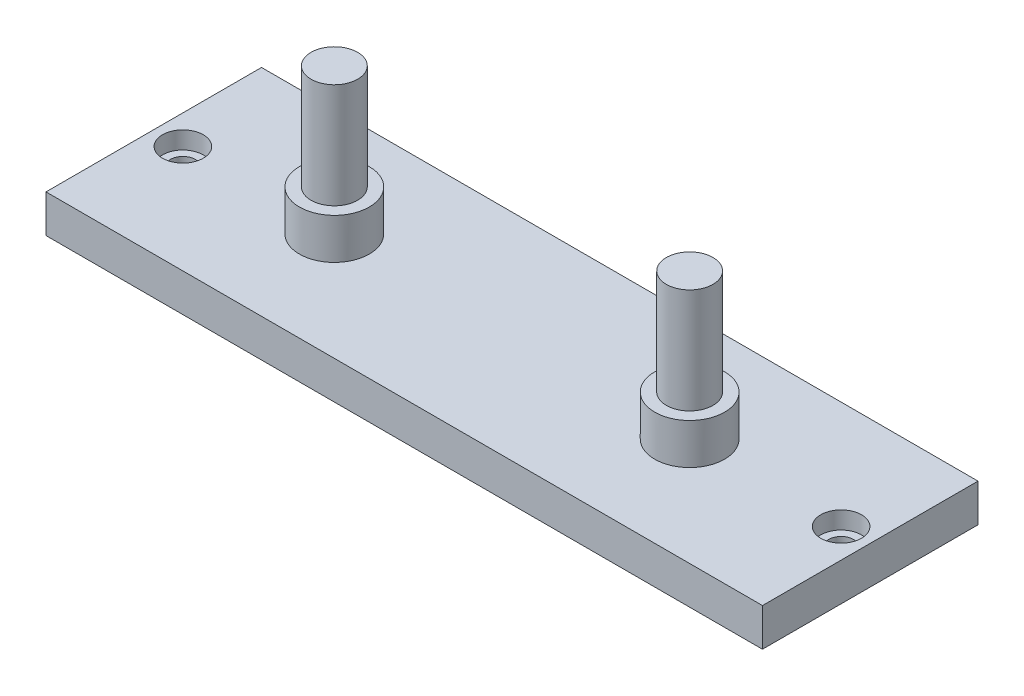
ISO-10303-21;
HEADER;
FILE_DESCRIPTION(('STEP AP214'),'2;1');
FILE_NAME('part.step','',(''),(''),'','','');
FILE_SCHEMA(('AUTOMOTIVE_DESIGN { 1 0 10303 214 1 1 1 1 }'));
ENDSEC;
DATA;
#1=APPLICATION_CONTEXT('core data for automotive mechanical design processes');
#2=APPLICATION_PROTOCOL_DEFINITION('international standard','automotive_design',2000,#1);
#3=PRODUCT_CONTEXT('',#1,'mechanical');
#4=PRODUCT('Part','Part','',(#3));
#5=PRODUCT_RELATED_PRODUCT_CATEGORY('part','',(#4));
#6=PRODUCT_DEFINITION_FORMATION('','',#4);
#7=PRODUCT_DEFINITION_CONTEXT('part definition',#1,'design');
#8=PRODUCT_DEFINITION('design','',#6,#7);
#9=PRODUCT_DEFINITION_SHAPE('','',#8);
#10=(LENGTH_UNIT() NAMED_UNIT(*) SI_UNIT(.MILLI.,.METRE.));
#11=(NAMED_UNIT(*) PLANE_ANGLE_UNIT() SI_UNIT($,.RADIAN.));
#12=(NAMED_UNIT(*) SI_UNIT($,.STERADIAN.) SOLID_ANGLE_UNIT());
#13=UNCERTAINTY_MEASURE_WITH_UNIT(LENGTH_MEASURE(1.E-05),#10,'distance_accuracy_value','');
#14=(GEOMETRIC_REPRESENTATION_CONTEXT(3) GLOBAL_UNCERTAINTY_ASSIGNED_CONTEXT((#13)) GLOBAL_UNIT_ASSIGNED_CONTEXT((#10,
#11,#12)) REPRESENTATION_CONTEXT('',''));
#15=CARTESIAN_POINT('',(0.,0.,0.));
#16=DIRECTION('',(0.,0.,1.));
#17=DIRECTION('',(1.,0.,0.));
#18=AXIS2_PLACEMENT_3D('',#15,#16,#17);
#19=CARTESIAN_POINT('',(0.,6.5,0.));
#20=DIRECTION('',(1.,0.,0.));
#21=DIRECTION('',(0.,0.,-1.));
#22=AXIS2_PLACEMENT_3D('',#19,#20,#21);
#23=PLANE('',#22);
#24=DIRECTION('',(0.,0.,1.));
#25=VECTOR('',#24,1.);
#26=CARTESIAN_POINT('',(0.,0.,0.));
#27=LINE('',#26,#25);
#28=CARTESIAN_POINT('',(0.,0.,-37.));
#29=VERTEX_POINT('',#28);
#30=CARTESIAN_POINT('',(0.,0.,0.));
#31=VERTEX_POINT('',#30);
#32=EDGE_CURVE('E102',#29,#31,#27,.T.);
#33=ORIENTED_EDGE('',*,*,#32,.T.);
#34=DIRECTION('',(0.,-1.,0.));
#35=VECTOR('',#34,1.);
#36=CARTESIAN_POINT('',(0.,6.5,0.));
#37=LINE('',#36,#35);
#38=CARTESIAN_POINT('',(0.,6.5,0.));
#39=VERTEX_POINT('',#38);
#40=EDGE_CURVE('E93',#39,#31,#37,.T.);
#41=ORIENTED_EDGE('',*,*,#40,.F.);
#42=DIRECTION('',(0.,0.,1.));
#43=VECTOR('',#42,1.);
#44=CARTESIAN_POINT('',(0.,6.5,0.));
#45=LINE('',#44,#43);
#46=CARTESIAN_POINT('',(0.,6.5,-37.));
#47=VERTEX_POINT('',#46);
#48=EDGE_CURVE('E87',#47,#39,#45,.T.);
#49=ORIENTED_EDGE('',*,*,#48,.F.);
#50=DIRECTION('',(0.,-1.,0.));
#51=VECTOR('',#50,1.);
#52=CARTESIAN_POINT('',(0.,6.5,-37.));
#53=LINE('',#52,#51);
#54=EDGE_CURVE('E98',#47,#29,#53,.T.);
#55=ORIENTED_EDGE('',*,*,#54,.T.);
#56=EDGE_LOOP('',(#33,#41,#49,#55));
#57=FACE_BOUND('',#56,.T.);
#58=ADVANCED_FACE('F35',(#57),#23,.F.);
#59=CARTESIAN_POINT('',(0.,6.5,0.));
#60=DIRECTION('',(0.,0.,-1.));
#61=DIRECTION('',(-1.,0.,0.));
#62=AXIS2_PLACEMENT_3D('',#59,#60,#61);
#63=PLANE('',#62);
#64=DIRECTION('',(1.,0.,0.));
#65=VECTOR('',#64,1.);
#66=CARTESIAN_POINT('',(0.,0.,0.));
#67=LINE('',#66,#65);
#68=CARTESIAN_POINT('',(123.,0.,0.));
#69=VERTEX_POINT('',#68);
#70=EDGE_CURVE('E92',#31,#69,#67,.T.);
#71=ORIENTED_EDGE('',*,*,#70,.T.);
#72=DIRECTION('',(0.,-1.,0.));
#73=VECTOR('',#72,1.);
#74=CARTESIAN_POINT('',(123.,6.5,0.));
#75=LINE('',#74,#73);
#76=CARTESIAN_POINT('',(123.,6.5,0.));
#77=VERTEX_POINT('',#76);
#78=EDGE_CURVE('E90',#77,#69,#75,.T.);
#79=ORIENTED_EDGE('',*,*,#78,.F.);
#80=DIRECTION('',(1.,0.,0.));
#81=VECTOR('',#80,1.);
#82=CARTESIAN_POINT('',(0.,6.5,0.));
#83=LINE('',#82,#81);
#84=EDGE_CURVE('E82',#39,#77,#83,.T.);
#85=ORIENTED_EDGE('',*,*,#84,.F.);
#86=ORIENTED_EDGE('',*,*,#40,.T.);
#87=EDGE_LOOP('',(#71,#79,#85,#86));
#88=FACE_BOUND('',#87,.T.);
#89=ADVANCED_FACE('F91',(#88),#63,.F.);
#90=CARTESIAN_POINT('',(123.,6.5,0.));
#91=DIRECTION('',(-1.,0.,0.));
#92=DIRECTION('',(0.,0.,1.));
#93=AXIS2_PLACEMENT_3D('',#90,#91,#92);
#94=PLANE('',#93);
#95=DIRECTION('',(0.,0.,-1.));
#96=VECTOR('',#95,1.);
#97=CARTESIAN_POINT('',(123.,0.,0.));
#98=LINE('',#97,#96);
#99=CARTESIAN_POINT('',(123.,0.,-37.));
#100=VERTEX_POINT('',#99);
#101=EDGE_CURVE('E68',#69,#100,#98,.T.);
#102=ORIENTED_EDGE('',*,*,#101,.T.);
#103=DIRECTION('',(0.,-1.,0.));
#104=VECTOR('',#103,1.);
#105=CARTESIAN_POINT('',(123.,6.5,-37.));
#106=LINE('',#105,#104);
#107=CARTESIAN_POINT('',(123.,6.5,-37.));
#108=VERTEX_POINT('',#107);
#109=EDGE_CURVE('E94',#108,#100,#106,.T.);
#110=ORIENTED_EDGE('',*,*,#109,.F.);
#111=DIRECTION('',(0.,0.,-1.));
#112=VECTOR('',#111,1.);
#113=CARTESIAN_POINT('',(123.,6.5,0.));
#114=LINE('',#113,#112);
#115=EDGE_CURVE('E85',#77,#108,#114,.T.);
#116=ORIENTED_EDGE('',*,*,#115,.F.);
#117=ORIENTED_EDGE('',*,*,#78,.T.);
#118=EDGE_LOOP('',(#102,#110,#116,#117));
#119=FACE_BOUND('',#118,.T.);
#120=ADVANCED_FACE('F96',(#119),#94,.F.);
#121=CARTESIAN_POINT('',(0.,6.5,-37.));
#122=DIRECTION('',(0.,0.,1.));
#123=DIRECTION('',(1.,0.,0.));
#124=AXIS2_PLACEMENT_3D('',#121,#122,#123);
#125=PLANE('',#124);
#126=DIRECTION('',(-1.,0.,0.));
#127=VECTOR('',#126,1.);
#128=CARTESIAN_POINT('',(0.,0.,-37.));
#129=LINE('',#128,#127);
#130=EDGE_CURVE('E74',#100,#29,#129,.T.);
#131=ORIENTED_EDGE('',*,*,#130,.T.);
#132=ORIENTED_EDGE('',*,*,#54,.F.);
#133=DIRECTION('',(-1.,0.,0.));
#134=VECTOR('',#133,1.);
#135=CARTESIAN_POINT('',(0.,6.5,-37.));
#136=LINE('',#135,#134);
#137=EDGE_CURVE('E51',#108,#47,#136,.T.);
#138=ORIENTED_EDGE('',*,*,#137,.F.);
#139=ORIENTED_EDGE('',*,*,#109,.T.);
#140=EDGE_LOOP('',(#131,#132,#138,#139));
#141=FACE_BOUND('',#140,.T.);
#142=ADVANCED_FACE('F182',(#141),#125,.F.);
#143=CARTESIAN_POINT('',(0.,6.5,0.));
#144=DIRECTION('',(0.,-1.,0.));
#145=DIRECTION('',(0.,0.,-1.));
#146=AXIS2_PLACEMENT_3D('',#143,#144,#145);
#147=PLANE('',#146);
#148=CARTESIAN_POINT('',(92.,6.5,-18.5));
#149=DIRECTION('',(0.,-1.,0.));
#150=DIRECTION('',(0.,0.,-1.));
#151=AXIS2_PLACEMENT_3D('',#148,#149,#150);
#152=CIRCLE('',#151,6.);
#153=CARTESIAN_POINT('',(92.,6.5,-24.5));
#154=VERTEX_POINT('',#153);
#155=EDGE_CURVE('E11',#154,#154,#152,.F.);
#156=ORIENTED_EDGE('',*,*,#155,.F.);
#157=EDGE_LOOP('',(#156));
#158=FACE_BOUND('',#157,.T.);
#159=CARTESIAN_POINT('',(31.,6.5,-18.5));
#160=DIRECTION('',(0.,-1.,0.));
#161=DIRECTION('',(0.,0.,-1.));
#162=AXIS2_PLACEMENT_3D('',#159,#160,#161);
#163=CIRCLE('',#162,6.);
#164=CARTESIAN_POINT('',(31.,6.5,-24.5));
#165=VERTEX_POINT('',#164);
#166=EDGE_CURVE('E43',#165,#165,#163,.F.);
#167=ORIENTED_EDGE('',*,*,#166,.F.);
#168=EDGE_LOOP('',(#167));
#169=FACE_BOUND('',#168,.T.);
#170=CARTESIAN_POINT('',(5.,6.5,-18.5));
#171=DIRECTION('',(0.,1.,0.));
#172=DIRECTION('',(0.,0.,1.));
#173=AXIS2_PLACEMENT_3D('',#170,#171,#172);
#174=CIRCLE('',#173,3.5);
#175=CARTESIAN_POINT('',(5.,6.5,-15.));
#176=VERTEX_POINT('',#175);
#177=EDGE_CURVE('E135',#176,#176,#174,.T.);
#178=ORIENTED_EDGE('',*,*,#177,.F.);
#179=EDGE_LOOP('',(#178));
#180=FACE_BOUND('',#179,.T.);
#181=CARTESIAN_POINT('',(118.,6.5,-18.5));
#182=DIRECTION('',(0.,1.,0.));
#183=DIRECTION('',(0.,0.,1.));
#184=AXIS2_PLACEMENT_3D('',#181,#182,#183);
#185=CIRCLE('',#184,3.5);
#186=CARTESIAN_POINT('',(118.,6.5,-15.));
#187=VERTEX_POINT('',#186);
#188=EDGE_CURVE('E147',#187,#187,#185,.T.);
#189=ORIENTED_EDGE('',*,*,#188,.F.);
#190=EDGE_LOOP('',(#189));
#191=FACE_BOUND('',#190,.T.);
#192=ORIENTED_EDGE('',*,*,#48,.T.);
#193=ORIENTED_EDGE('',*,*,#84,.T.);
#194=ORIENTED_EDGE('',*,*,#115,.T.);
#195=ORIENTED_EDGE('',*,*,#137,.T.);
#196=EDGE_LOOP('',(#192,#193,#194,#195));
#197=FACE_BOUND('',#196,.T.);
#198=ADVANCED_FACE('F83',(#158,#169,#180,#191,#197),#147,.F.);
#199=CARTESIAN_POINT('',(0.,0.,0.));
#200=DIRECTION('',(0.,-1.,0.));
#201=DIRECTION('',(0.,0.,-1.));
#202=AXIS2_PLACEMENT_3D('',#199,#200,#201);
#203=PLANE('',#202);
#204=CARTESIAN_POINT('',(5.,0.,-18.5));
#205=DIRECTION('',(0.,1.,0.));
#206=DIRECTION('',(0.,0.,1.));
#207=AXIS2_PLACEMENT_3D('',#204,#205,#206);
#208=CIRCLE('',#207,2.15);
#209=CARTESIAN_POINT('',(5.,0.,-16.35));
#210=VERTEX_POINT('',#209);
#211=EDGE_CURVE('E144',#210,#210,#208,.T.);
#212=ORIENTED_EDGE('',*,*,#211,.T.);
#213=EDGE_LOOP('',(#212));
#214=FACE_BOUND('',#213,.T.);
#215=CARTESIAN_POINT('',(118.,0.,-18.5));
#216=DIRECTION('',(0.,1.,0.));
#217=DIRECTION('',(0.,0.,1.));
#218=AXIS2_PLACEMENT_3D('',#215,#216,#217);
#219=CIRCLE('',#218,2.15);
#220=CARTESIAN_POINT('',(118.,0.,-16.35));
#221=VERTEX_POINT('',#220);
#222=EDGE_CURVE('E105',#221,#221,#219,.T.);
#223=ORIENTED_EDGE('',*,*,#222,.T.);
#224=EDGE_LOOP('',(#223));
#225=FACE_BOUND('',#224,.T.);
#226=ORIENTED_EDGE('',*,*,#32,.F.);
#227=ORIENTED_EDGE('',*,*,#130,.F.);
#228=ORIENTED_EDGE('',*,*,#101,.F.);
#229=ORIENTED_EDGE('',*,*,#70,.F.);
#230=EDGE_LOOP('',(#226,#227,#228,#229));
#231=FACE_BOUND('',#230,.T.);
#232=ADVANCED_FACE('F159',(#214,#225,#231),#203,.T.);
#233=CARTESIAN_POINT('',(118.,6.5,-18.5));
#234=DIRECTION('',(0.,1.,0.));
#235=DIRECTION('',(0.,0.,1.));
#236=AXIS2_PLACEMENT_3D('',#233,#234,#235);
#237=CYLINDRICAL_SURFACE('',#236,2.15);
#238=ORIENTED_EDGE('',*,*,#222,.F.);
#239=EDGE_LOOP('',(#238));
#240=FACE_BOUND('',#239,.T.);
#241=CARTESIAN_POINT('',(118.,3.5,-18.5));
#242=DIRECTION('',(0.,1.,0.));
#243=DIRECTION('',(0.,0.,1.));
#244=AXIS2_PLACEMENT_3D('',#241,#242,#243);
#245=CIRCLE('',#244,2.15);
#246=CARTESIAN_POINT('',(118.,3.5,-16.35));
#247=VERTEX_POINT('',#246);
#248=EDGE_CURVE('E153',#247,#247,#245,.T.);
#249=ORIENTED_EDGE('',*,*,#248,.T.);
#250=EDGE_LOOP('',(#249));
#251=FACE_BOUND('',#250,.T.);
#252=ADVANCED_FACE('F162',(#240,#251),#237,.F.);
#253=CARTESIAN_POINT('',(120.15,3.5,-18.5));
#254=DIRECTION('',(0.,-1.,0.));
#255=DIRECTION('',(0.,0.,-1.));
#256=AXIS2_PLACEMENT_3D('',#253,#254,#255);
#257=PLANE('',#256);
#258=ORIENTED_EDGE('',*,*,#248,.F.);
#259=EDGE_LOOP('',(#258));
#260=FACE_BOUND('',#259,.T.);
#261=CARTESIAN_POINT('',(118.,3.5,-18.5));
#262=DIRECTION('',(0.,1.,0.));
#263=DIRECTION('',(0.,0.,1.));
#264=AXIS2_PLACEMENT_3D('',#261,#262,#263);
#265=CIRCLE('',#264,3.5);
#266=CARTESIAN_POINT('',(118.,3.5,-15.));
#267=VERTEX_POINT('',#266);
#268=EDGE_CURVE('E150',#267,#267,#265,.T.);
#269=ORIENTED_EDGE('',*,*,#268,.T.);
#270=EDGE_LOOP('',(#269));
#271=FACE_BOUND('',#270,.T.);
#272=ADVANCED_FACE('F165',(#260,#271),#257,.F.);
#273=CARTESIAN_POINT('',(118.,6.5,-18.5));
#274=DIRECTION('',(0.,1.,0.));
#275=DIRECTION('',(0.,0.,1.));
#276=AXIS2_PLACEMENT_3D('',#273,#274,#275);
#277=CYLINDRICAL_SURFACE('',#276,3.5);
#278=ORIENTED_EDGE('',*,*,#268,.F.);
#279=EDGE_LOOP('',(#278));
#280=FACE_BOUND('',#279,.T.);
#281=ORIENTED_EDGE('',*,*,#188,.T.);
#282=EDGE_LOOP('',(#281));
#283=FACE_BOUND('',#282,.T.);
#284=ADVANCED_FACE('F171',(#280,#283),#277,.F.);
#285=CARTESIAN_POINT('',(5.,6.5,-18.5));
#286=DIRECTION('',(0.,1.,0.));
#287=DIRECTION('',(0.,0.,1.));
#288=AXIS2_PLACEMENT_3D('',#285,#286,#287);
#289=CYLINDRICAL_SURFACE('',#288,2.15);
#290=ORIENTED_EDGE('',*,*,#211,.F.);
#291=EDGE_LOOP('',(#290));
#292=FACE_BOUND('',#291,.T.);
#293=CARTESIAN_POINT('',(5.,3.5,-18.5));
#294=DIRECTION('',(0.,1.,0.));
#295=DIRECTION('',(0.,0.,1.));
#296=AXIS2_PLACEMENT_3D('',#293,#294,#295);
#297=CIRCLE('',#296,2.15);
#298=CARTESIAN_POINT('',(5.,3.5,-16.35));
#299=VERTEX_POINT('',#298);
#300=EDGE_CURVE('E141',#299,#299,#297,.T.);
#301=ORIENTED_EDGE('',*,*,#300,.T.);
#302=EDGE_LOOP('',(#301));
#303=FACE_BOUND('',#302,.T.);
#304=ADVANCED_FACE('F177',(#292,#303),#289,.F.);
#305=CARTESIAN_POINT('',(7.15,3.5,-18.5));
#306=DIRECTION('',(0.,-1.,0.));
#307=DIRECTION('',(0.,0.,-1.));
#308=AXIS2_PLACEMENT_3D('',#305,#306,#307);
#309=PLANE('',#308);
#310=ORIENTED_EDGE('',*,*,#300,.F.);
#311=EDGE_LOOP('',(#310));
#312=FACE_BOUND('',#311,.T.);
#313=CARTESIAN_POINT('',(5.,3.5,-18.5));
#314=DIRECTION('',(0.,1.,0.));
#315=DIRECTION('',(0.,0.,1.));
#316=AXIS2_PLACEMENT_3D('',#313,#314,#315);
#317=CIRCLE('',#316,3.5);
#318=CARTESIAN_POINT('',(5.,3.5,-15.));
#319=VERTEX_POINT('',#318);
#320=EDGE_CURVE('E138',#319,#319,#317,.T.);
#321=ORIENTED_EDGE('',*,*,#320,.T.);
#322=EDGE_LOOP('',(#321));
#323=FACE_BOUND('',#322,.T.);
#324=ADVANCED_FACE('F244',(#312,#323),#309,.F.);
#325=CARTESIAN_POINT('',(5.,6.5,-18.5));
#326=DIRECTION('',(0.,1.,0.));
#327=DIRECTION('',(0.,0.,1.));
#328=AXIS2_PLACEMENT_3D('',#325,#326,#327);
#329=CYLINDRICAL_SURFACE('',#328,3.5);
#330=ORIENTED_EDGE('',*,*,#320,.F.);
#331=EDGE_LOOP('',(#330));
#332=FACE_BOUND('',#331,.T.);
#333=ORIENTED_EDGE('',*,*,#177,.T.);
#334=EDGE_LOOP('',(#333));
#335=FACE_BOUND('',#334,.T.);
#336=ADVANCED_FACE('F254',(#332,#335),#329,.F.);
#337=CARTESIAN_POINT('',(31.,13.5,-18.5));
#338=DIRECTION('',(0.,-1.,0.));
#339=DIRECTION('',(0.,0.,-1.));
#340=AXIS2_PLACEMENT_3D('',#337,#338,#339);
#341=CYLINDRICAL_SURFACE('',#340,6.);
#342=CARTESIAN_POINT('',(31.,13.5,-18.5));
#343=DIRECTION('',(0.,1.,0.));
#344=DIRECTION('',(0.,0.,1.));
#345=AXIS2_PLACEMENT_3D('',#342,#343,#344);
#346=CIRCLE('',#345,6.);
#347=CARTESIAN_POINT('',(31.,13.5,-12.5));
#348=VERTEX_POINT('',#347);
#349=EDGE_CURVE('E116',#348,#348,#346,.T.);
#350=ORIENTED_EDGE('',*,*,#349,.F.);
#351=EDGE_LOOP('',(#350));
#352=FACE_BOUND('',#351,.T.);
#353=ORIENTED_EDGE('',*,*,#166,.T.);
#354=EDGE_LOOP('',(#353));
#355=FACE_BOUND('',#354,.T.);
#356=ADVANCED_FACE('F264',(#352,#355),#341,.T.);
#357=CARTESIAN_POINT('',(31.,13.5,-18.5));
#358=DIRECTION('',(0.,1.,0.));
#359=DIRECTION('',(0.,0.,1.));
#360=AXIS2_PLACEMENT_3D('',#357,#358,#359);
#361=PLANE('',#360);
#362=CARTESIAN_POINT('',(31.,13.5,-18.5));
#363=DIRECTION('',(0.,1.,0.));
#364=DIRECTION('',(0.,0.,1.));
#365=AXIS2_PLACEMENT_3D('',#362,#363,#364);
#366=CIRCLE('',#365,4.00000000000001);
#367=CARTESIAN_POINT('',(31.,13.5,-14.5));
#368=VERTEX_POINT('',#367);
#369=EDGE_CURVE('E112',#368,#368,#366,.T.);
#370=ORIENTED_EDGE('',*,*,#369,.F.);
#371=EDGE_LOOP('',(#370));
#372=FACE_BOUND('',#371,.T.);
#373=ORIENTED_EDGE('',*,*,#349,.T.);
#374=EDGE_LOOP('',(#373));
#375=FACE_BOUND('',#374,.T.);
#376=ADVANCED_FACE('F278',(#372,#375),#361,.T.);
#377=CARTESIAN_POINT('',(31.,31.5,-18.5));
#378=DIRECTION('',(0.,1.,0.));
#379=DIRECTION('',(0.,0.,1.));
#380=AXIS2_PLACEMENT_3D('',#377,#378,#379);
#381=PLANE('',#380);
#382=CARTESIAN_POINT('',(31.,31.5,-18.5));
#383=DIRECTION('',(0.,1.,0.));
#384=DIRECTION('',(0.,0.,1.));
#385=AXIS2_PLACEMENT_3D('',#382,#383,#384);
#386=CIRCLE('',#385,4.00000000000001);
#387=CARTESIAN_POINT('',(31.,31.5,-14.5));
#388=VERTEX_POINT('',#387);
#389=EDGE_CURVE('E132',#388,#388,#386,.T.);
#390=ORIENTED_EDGE('',*,*,#389,.T.);
#391=EDGE_LOOP('',(#390));
#392=FACE_BOUND('',#391,.T.);
#393=ADVANCED_FACE('F272',(#392),#381,.T.);
#394=CARTESIAN_POINT('',(31.,31.5,-18.5));
#395=DIRECTION('',(0.,-1.,0.));
#396=DIRECTION('',(0.,0.,-1.));
#397=AXIS2_PLACEMENT_3D('',#394,#395,#396);
#398=CYLINDRICAL_SURFACE('',#397,4.00000000000001);
#399=ORIENTED_EDGE('',*,*,#369,.T.);
#400=EDGE_LOOP('',(#399));
#401=FACE_BOUND('',#400,.T.);
#402=ORIENTED_EDGE('',*,*,#389,.F.);
#403=EDGE_LOOP('',(#402));
#404=FACE_BOUND('',#403,.T.);
#405=ADVANCED_FACE('F277',(#401,#404),#398,.T.);
#406=CARTESIAN_POINT('',(92.,13.5,-18.5));
#407=DIRECTION('',(0.,-1.,0.));
#408=DIRECTION('',(0.,0.,-1.));
#409=AXIS2_PLACEMENT_3D('',#406,#407,#408);
#410=CYLINDRICAL_SURFACE('',#409,6.);
#411=CARTESIAN_POINT('',(92.,13.5,-18.5));
#412=DIRECTION('',(0.,1.,0.));
#413=DIRECTION('',(0.,0.,1.));
#414=AXIS2_PLACEMENT_3D('',#411,#412,#413);
#415=CIRCLE('',#414,6.);
#416=CARTESIAN_POINT('',(92.,13.5,-12.5));
#417=VERTEX_POINT('',#416);
#418=EDGE_CURVE('E120',#417,#417,#415,.T.);
#419=ORIENTED_EDGE('',*,*,#418,.F.);
#420=EDGE_LOOP('',(#419));
#421=FACE_BOUND('',#420,.T.);
#422=ORIENTED_EDGE('',*,*,#155,.T.);
#423=EDGE_LOOP('',(#422));
#424=FACE_BOUND('',#423,.T.);
#425=ADVANCED_FACE('F323',(#421,#424),#410,.T.);
#426=CARTESIAN_POINT('',(92.,13.5,-18.5));
#427=DIRECTION('',(0.,1.,0.));
#428=DIRECTION('',(0.,0.,1.));
#429=AXIS2_PLACEMENT_3D('',#426,#427,#428);
#430=PLANE('',#429);
#431=CARTESIAN_POINT('',(92.,13.5,-18.5));
#432=DIRECTION('',(0.,1.,0.));
#433=DIRECTION('',(0.,0.,1.));
#434=AXIS2_PLACEMENT_3D('',#431,#432,#433);
#435=CIRCLE('',#434,4.00000000000001);
#436=CARTESIAN_POINT('',(92.,13.5,-14.5));
#437=VERTEX_POINT('',#436);
#438=EDGE_CURVE('E118',#437,#437,#435,.T.);
#439=ORIENTED_EDGE('',*,*,#438,.F.);
#440=EDGE_LOOP('',(#439));
#441=FACE_BOUND('',#440,.T.);
#442=ORIENTED_EDGE('',*,*,#418,.T.);
#443=EDGE_LOOP('',(#442));
#444=FACE_BOUND('',#443,.T.);
#445=ADVANCED_FACE('F292',(#441,#444),#430,.T.);
#446=CARTESIAN_POINT('',(92.,31.5,-18.5));
#447=DIRECTION('',(0.,1.,0.));
#448=DIRECTION('',(0.,0.,1.));
#449=AXIS2_PLACEMENT_3D('',#446,#447,#448);
#450=PLANE('',#449);
#451=CARTESIAN_POINT('',(92.,31.5,-18.5));
#452=DIRECTION('',(0.,1.,0.));
#453=DIRECTION('',(0.,0.,1.));
#454=AXIS2_PLACEMENT_3D('',#451,#452,#453);
#455=CIRCLE('',#454,4.00000000000001);
#456=CARTESIAN_POINT('',(92.,31.5,-14.5));
#457=VERTEX_POINT('',#456);
#458=EDGE_CURVE('E115',#457,#457,#455,.T.);
#459=ORIENTED_EDGE('',*,*,#458,.T.);
#460=EDGE_LOOP('',(#459));
#461=FACE_BOUND('',#460,.T.);
#462=ADVANCED_FACE('F287',(#461),#450,.T.);
#463=CARTESIAN_POINT('',(92.,31.5,-18.5));
#464=DIRECTION('',(0.,-1.,0.));
#465=DIRECTION('',(0.,0.,-1.));
#466=AXIS2_PLACEMENT_3D('',#463,#464,#465);
#467=CYLINDRICAL_SURFACE('',#466,4.00000000000001);
#468=ORIENTED_EDGE('',*,*,#438,.T.);
#469=EDGE_LOOP('',(#468));
#470=FACE_BOUND('',#469,.T.);
#471=ORIENTED_EDGE('',*,*,#458,.F.);
#472=EDGE_LOOP('',(#471));
#473=FACE_BOUND('',#472,.T.);
#474=ADVANCED_FACE('F291',(#470,#473),#467,.T.);
#475=CLOSED_SHELL('',(#58,#89,#120,#142,#198,#232,#252,#272,#284,#304,#324,#336,#356,#376,#393,
#405,#425,#445,#462,#474));
#476=MANIFOLD_SOLID_BREP('B2',#475);
#477=ADVANCED_BREP_SHAPE_REPRESENTATION('',(#18,#476),#14);
#478=SHAPE_DEFINITION_REPRESENTATION(#9,#477);
ENDSEC;
END-ISO-10303-21;
